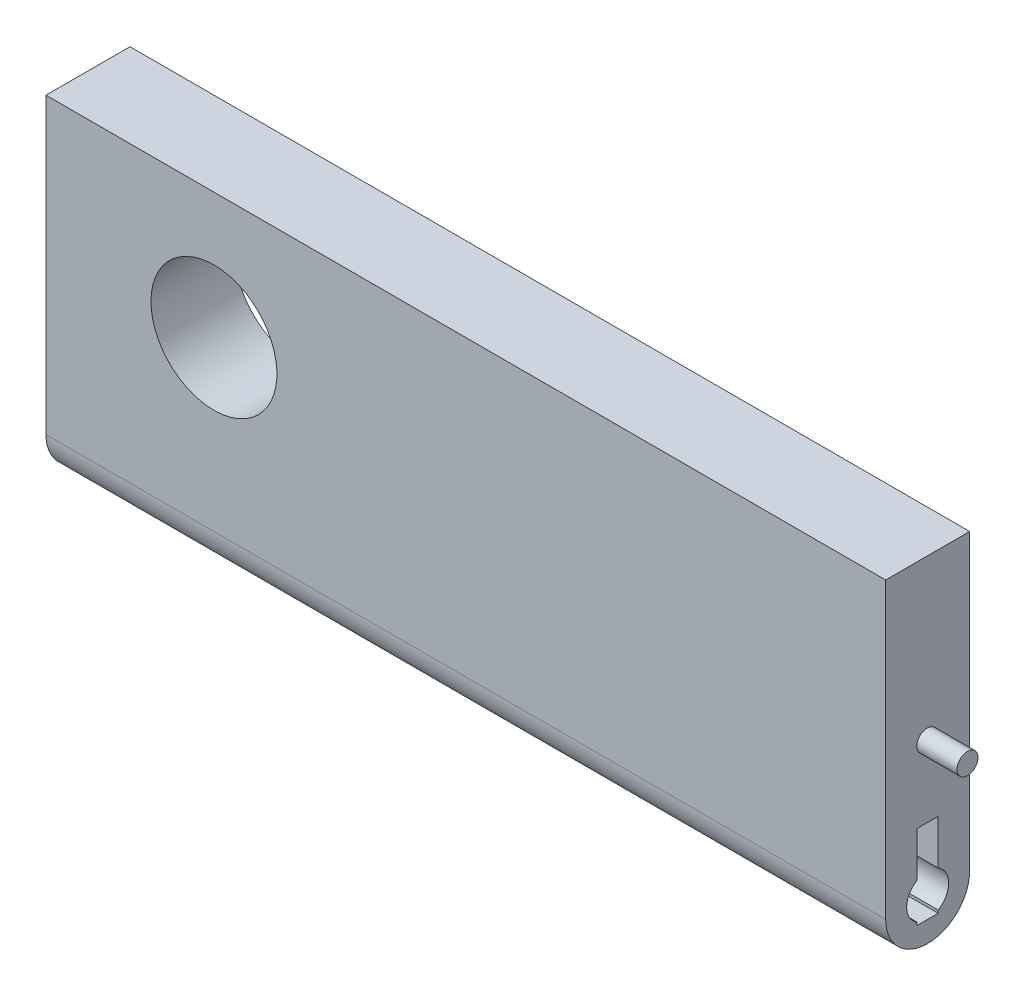
ISO-10303-21;
HEADER;
FILE_DESCRIPTION(('STEP AP214'),'2;1');
FILE_NAME('part.step','',(''),(''),'','','');
FILE_SCHEMA(('AUTOMOTIVE_DESIGN { 1 0 10303 214 1 1 1 1 }'));
ENDSEC;
DATA;
#1=APPLICATION_CONTEXT('core data for automotive mechanical design processes');
#2=APPLICATION_PROTOCOL_DEFINITION('international standard','automotive_design',2000,#1);
#3=PRODUCT_CONTEXT('',#1,'mechanical');
#4=PRODUCT('Part','Part','',(#3));
#5=PRODUCT_RELATED_PRODUCT_CATEGORY('part','',(#4));
#6=PRODUCT_DEFINITION_FORMATION('','',#4);
#7=PRODUCT_DEFINITION_CONTEXT('part definition',#1,'design');
#8=PRODUCT_DEFINITION('design','',#6,#7);
#9=PRODUCT_DEFINITION_SHAPE('','',#8);
#10=(LENGTH_UNIT() NAMED_UNIT(*) SI_UNIT(.MILLI.,.METRE.));
#11=(NAMED_UNIT(*) PLANE_ANGLE_UNIT() SI_UNIT($,.RADIAN.));
#12=(NAMED_UNIT(*) SI_UNIT($,.STERADIAN.) SOLID_ANGLE_UNIT());
#13=UNCERTAINTY_MEASURE_WITH_UNIT(LENGTH_MEASURE(1.E-05),#10,'distance_accuracy_value','');
#14=(GEOMETRIC_REPRESENTATION_CONTEXT(3) GLOBAL_UNCERTAINTY_ASSIGNED_CONTEXT((#13)) GLOBAL_UNIT_ASSIGNED_CONTEXT((#10,
#11,#12)) REPRESENTATION_CONTEXT('',''));
#15=CARTESIAN_POINT('',(0.,0.,0.));
#16=DIRECTION('',(0.,0.,1.));
#17=DIRECTION('',(1.,0.,0.));
#18=AXIS2_PLACEMENT_3D('',#15,#16,#17);
#19=CARTESIAN_POINT('',(28.575,0.,6.35));
#20=DIRECTION('',(-1.,0.,0.));
#21=DIRECTION('',(0.,0.,1.));
#22=AXIS2_PLACEMENT_3D('',#19,#20,#21);
#23=PLANE('',#22);
#24=CARTESIAN_POINT('',(28.575,0.635000000000002,3.20954009812846));
#25=DIRECTION('',(-1.,0.,0.));
#26=DIRECTION('',(0.,0.,1.));
#27=AXIS2_PLACEMENT_3D('',#24,#25,#26);
#28=CIRCLE('',#27,0.79375);
#29=CARTESIAN_POINT('',(28.575,0.635000000000002,4.00329009812846));
#30=VERTEX_POINT('',#29);
#31=EDGE_CURVE('E11',#30,#30,#28,.F.);
#32=ORIENTED_EDGE('',*,*,#31,.F.);
#33=EDGE_LOOP('',(#32));
#34=FACE_BOUND('',#33,.T.);
#35=CARTESIAN_POINT('',(28.575,-9.525,3.175));
#36=DIRECTION('',(1.,0.,0.));
#37=DIRECTION('',(0.,0.,-1.));
#38=AXIS2_PLACEMENT_3D('',#35,#36,#37);
#39=CIRCLE('',#38,1.5875);
#40=CARTESIAN_POINT('',(28.575,-10.8998153285078,2.38125));
#41=VERTEX_POINT('',#40);
#42=CARTESIAN_POINT('',(28.575,-8.1501846714922,2.38125));
#43=VERTEX_POINT('',#42);
#44=EDGE_CURVE('E242',#41,#43,#39,.T.);
#45=ORIENTED_EDGE('',*,*,#44,.F.);
#46=DIRECTION('',(0.,1.,0.));
#47=VECTOR('',#46,1.);
#48=CARTESIAN_POINT('',(28.575,-11.1125,2.38125));
#49=LINE('',#48,#47);
#50=CARTESIAN_POINT('',(28.575,-11.1125,2.38125));
#51=VERTEX_POINT('',#50);
#52=EDGE_CURVE('E205',#51,#41,#49,.T.);
#53=ORIENTED_EDGE('',*,*,#52,.F.);
#54=DIRECTION('',(0.,0.,-1.));
#55=VECTOR('',#54,1.);
#56=CARTESIAN_POINT('',(28.575,-11.1125,3.96875));
#57=LINE('',#56,#55);
#58=CARTESIAN_POINT('',(28.575,-11.1125,3.96875));
#59=VERTEX_POINT('',#58);
#60=EDGE_CURVE('E177',#59,#51,#57,.T.);
#61=ORIENTED_EDGE('',*,*,#60,.F.);
#62=DIRECTION('',(0.,-1.,0.));
#63=VECTOR('',#62,1.);
#64=CARTESIAN_POINT('',(28.575,-11.1125,3.96875));
#65=LINE('',#64,#63);
#66=CARTESIAN_POINT('',(28.575,-10.8998153285078,3.96875));
#67=VERTEX_POINT('',#66);
#68=EDGE_CURVE('E211',#67,#59,#65,.T.);
#69=ORIENTED_EDGE('',*,*,#68,.F.);
#70=CARTESIAN_POINT('',(28.575,-8.1501846714922,3.96875));
#71=VERTEX_POINT('',#70);
#72=EDGE_CURVE('E241',#71,#67,#39,.T.);
#73=ORIENTED_EDGE('',*,*,#72,.F.);
#74=CARTESIAN_POINT('',(28.575,-4.7625,3.96875));
#75=VERTEX_POINT('',#74);
#76=EDGE_CURVE('E212',#75,#71,#65,.T.);
#77=ORIENTED_EDGE('',*,*,#76,.F.);
#78=DIRECTION('',(0.,0.,1.));
#79=VECTOR('',#78,1.);
#80=CARTESIAN_POINT('',(28.575,-4.7625,3.96875));
#81=LINE('',#80,#79);
#82=CARTESIAN_POINT('',(28.575,-4.7625,2.38125));
#83=VERTEX_POINT('',#82);
#84=EDGE_CURVE('E208',#83,#75,#81,.T.);
#85=ORIENTED_EDGE('',*,*,#84,.F.);
#86=EDGE_CURVE('E183',#43,#83,#49,.T.);
#87=ORIENTED_EDGE('',*,*,#86,.F.);
#88=EDGE_LOOP('',(#45,#53,#61,#69,#73,#77,#85,#87));
#89=FACE_BOUND('',#88,.T.);
#90=CARTESIAN_POINT('',(28.575,-9.525,3.175));
#91=DIRECTION('',(-1.,0.,0.));
#92=DIRECTION('',(0.,0.,1.));
#93=AXIS2_PLACEMENT_3D('',#90,#91,#92);
#94=CIRCLE('',#93,3.175);
#95=CARTESIAN_POINT('',(28.575,-9.525,6.35));
#96=VERTEX_POINT('',#95);
#97=CARTESIAN_POINT('',(28.575,-12.7,3.175));
#98=VERTEX_POINT('',#97);
#99=EDGE_CURVE('E283',#96,#98,#94,.F.);
#100=ORIENTED_EDGE('',*,*,#99,.T.);
#101=CARTESIAN_POINT('',(28.575,-9.525,3.175));
#102=DIRECTION('',(-1.,0.,0.));
#103=DIRECTION('',(0.,0.,1.));
#104=AXIS2_PLACEMENT_3D('',#101,#102,#103);
#105=CIRCLE('',#104,3.175);
#106=CARTESIAN_POINT('',(28.575,-9.525,0.));
#107=VERTEX_POINT('',#106);
#108=EDGE_CURVE('E286',#98,#107,#105,.F.);
#109=ORIENTED_EDGE('',*,*,#108,.T.);
#110=DIRECTION('',(0.,1.,0.));
#111=VECTOR('',#110,1.);
#112=CARTESIAN_POINT('',(28.575,0.,0.));
#113=LINE('',#112,#111);
#114=CARTESIAN_POINT('',(28.575,12.7,0.));
#115=VERTEX_POINT('',#114);
#116=EDGE_CURVE('E240',#107,#115,#113,.T.);
#117=ORIENTED_EDGE('',*,*,#116,.T.);
#118=DIRECTION('',(0.,0.,-1.));
#119=VECTOR('',#118,1.);
#120=CARTESIAN_POINT('',(28.575,12.7,6.35));
#121=LINE('',#120,#119);
#122=CARTESIAN_POINT('',(28.575,12.7,6.35));
#123=VERTEX_POINT('',#122);
#124=EDGE_CURVE('E269',#123,#115,#121,.T.);
#125=ORIENTED_EDGE('',*,*,#124,.F.);
#126=DIRECTION('',(0.,1.,0.));
#127=VECTOR('',#126,1.);
#128=CARTESIAN_POINT('',(28.575,0.,6.35));
#129=LINE('',#128,#127);
#130=EDGE_CURVE('E246',#96,#123,#129,.T.);
#131=ORIENTED_EDGE('',*,*,#130,.F.);
#132=EDGE_LOOP('',(#100,#109,#117,#125,#131));
#133=FACE_BOUND('',#132,.T.);
#134=ADVANCED_FACE('F43',(#34,#89,#133),#23,.F.);
#135=CARTESIAN_POINT('',(0.,12.7,6.35));
#136=DIRECTION('',(0.,-1.,0.));
#137=DIRECTION('',(1.,0.,0.));
#138=AXIS2_PLACEMENT_3D('',#135,#136,#137);
#139=PLANE('',#138);
#140=DIRECTION('',(-1.,0.,0.));
#141=VECTOR('',#140,1.);
#142=CARTESIAN_POINT('',(0.,12.7,0.));
#143=LINE('',#142,#141);
#144=CARTESIAN_POINT('',(-34.925,12.7,0.));
#145=VERTEX_POINT('',#144);
#146=EDGE_CURVE('E260',#115,#145,#143,.T.);
#147=ORIENTED_EDGE('',*,*,#146,.T.);
#148=DIRECTION('',(0.,0.,-1.));
#149=VECTOR('',#148,1.);
#150=CARTESIAN_POINT('',(-34.925,12.7,6.35));
#151=LINE('',#150,#149);
#152=CARTESIAN_POINT('',(-34.925,12.7,6.35));
#153=VERTEX_POINT('',#152);
#154=EDGE_CURVE('E257',#153,#145,#151,.T.);
#155=ORIENTED_EDGE('',*,*,#154,.F.);
#156=DIRECTION('',(-1.,0.,0.));
#157=VECTOR('',#156,1.);
#158=CARTESIAN_POINT('',(0.,12.7,6.35));
#159=LINE('',#158,#157);
#160=EDGE_CURVE('E249',#123,#153,#159,.T.);
#161=ORIENTED_EDGE('',*,*,#160,.F.);
#162=ORIENTED_EDGE('',*,*,#124,.T.);
#163=EDGE_LOOP('',(#147,#155,#161,#162));
#164=FACE_BOUND('',#163,.T.);
#165=ADVANCED_FACE('F339',(#164),#139,.F.);
#166=CARTESIAN_POINT('',(-34.925,0.,6.35));
#167=DIRECTION('',(-1.,0.,0.));
#168=DIRECTION('',(0.,0.,1.));
#169=AXIS2_PLACEMENT_3D('',#166,#167,#168);
#170=PLANE('',#169);
#171=CARTESIAN_POINT('',(-34.925,-9.525,3.175));
#172=DIRECTION('',(1.,0.,0.));
#173=DIRECTION('',(0.,0.,-1.));
#174=AXIS2_PLACEMENT_3D('',#171,#172,#173);
#175=CIRCLE('',#174,1.5875);
#176=CARTESIAN_POINT('',(-34.925,-9.525,1.5875));
#177=VERTEX_POINT('',#176);
#178=EDGE_CURVE('E236',#177,#177,#175,.T.);
#179=ORIENTED_EDGE('',*,*,#178,.T.);
#180=EDGE_LOOP('',(#179));
#181=FACE_BOUND('',#180,.T.);
#182=DIRECTION('',(0.,1.,0.));
#183=VECTOR('',#182,1.);
#184=CARTESIAN_POINT('',(-34.925,0.,0.));
#185=LINE('',#184,#183);
#186=CARTESIAN_POINT('',(-34.925,-9.52500000000001,0.));
#187=VERTEX_POINT('',#186);
#188=EDGE_CURVE('E250',#187,#145,#185,.T.);
#189=ORIENTED_EDGE('',*,*,#188,.F.);
#190=CARTESIAN_POINT('',(-34.925,-9.52500000000001,3.175));
#191=DIRECTION('',(-1.,0.,0.));
#192=DIRECTION('',(0.,0.,1.));
#193=AXIS2_PLACEMENT_3D('',#190,#191,#192);
#194=CIRCLE('',#193,3.175);
#195=CARTESIAN_POINT('',(-34.925,-12.7,3.175));
#196=VERTEX_POINT('',#195);
#197=EDGE_CURVE('E280',#187,#196,#194,.T.);
#198=ORIENTED_EDGE('',*,*,#197,.T.);
#199=CARTESIAN_POINT('',(-34.925,-9.52500000000001,3.175));
#200=DIRECTION('',(-1.,0.,0.));
#201=DIRECTION('',(0.,0.,1.));
#202=AXIS2_PLACEMENT_3D('',#199,#200,#201);
#203=CIRCLE('',#202,3.175);
#204=CARTESIAN_POINT('',(-34.925,-9.52500000000001,6.35));
#205=VERTEX_POINT('',#204);
#206=EDGE_CURVE('E277',#196,#205,#203,.T.);
#207=ORIENTED_EDGE('',*,*,#206,.T.);
#208=DIRECTION('',(0.,1.,0.));
#209=VECTOR('',#208,1.);
#210=CARTESIAN_POINT('',(-34.925,0.,6.35));
#211=LINE('',#210,#209);
#212=EDGE_CURVE('E254',#205,#153,#211,.T.);
#213=ORIENTED_EDGE('',*,*,#212,.T.);
#214=ORIENTED_EDGE('',*,*,#154,.T.);
#215=EDGE_LOOP('',(#189,#198,#207,#213,#214));
#216=FACE_BOUND('',#215,.T.);
#217=ADVANCED_FACE('F344',(#181,#216),#170,.T.);
#218=CARTESIAN_POINT('',(0.,0.,6.35));
#219=DIRECTION('',(0.,0.,1.));
#220=DIRECTION('',(1.,0.,0.));
#221=AXIS2_PLACEMENT_3D('',#218,#219,#220);
#222=PLANE('',#221);
#223=CARTESIAN_POINT('',(-22.225,3.175,6.35));
#224=DIRECTION('',(0.,0.,-1.));
#225=DIRECTION('',(-1.,0.,0.));
#226=AXIS2_PLACEMENT_3D('',#223,#224,#225);
#227=CIRCLE('',#226,4.7625);
#228=CARTESIAN_POINT('',(-26.9875,3.175,6.35));
#229=VERTEX_POINT('',#228);
#230=EDGE_CURVE('E228',#229,#229,#227,.T.);
#231=ORIENTED_EDGE('',*,*,#230,.T.);
#232=EDGE_LOOP('',(#231));
#233=FACE_BOUND('',#232,.T.);
#234=ORIENTED_EDGE('',*,*,#212,.F.);
#235=DIRECTION('',(-1.,0.,0.));
#236=VECTOR('',#235,1.);
#237=CARTESIAN_POINT('',(0.,-9.52500000000001,6.35));
#238=LINE('',#237,#236);
#239=EDGE_CURVE('E289',#205,#96,#238,.F.);
#240=ORIENTED_EDGE('',*,*,#239,.T.);
#241=ORIENTED_EDGE('',*,*,#130,.T.);
#242=ORIENTED_EDGE('',*,*,#160,.T.);
#243=EDGE_LOOP('',(#234,#240,#241,#242));
#244=FACE_BOUND('',#243,.T.);
#245=ADVANCED_FACE('F377',(#233,#244),#222,.T.);
#246=CARTESIAN_POINT('',(0.,0.,0.));
#247=DIRECTION('',(0.,0.,1.));
#248=DIRECTION('',(1.,0.,0.));
#249=AXIS2_PLACEMENT_3D('',#246,#247,#248);
#250=PLANE('',#249);
#251=CARTESIAN_POINT('',(-22.225,3.175,0.));
#252=DIRECTION('',(0.,0.,-1.));
#253=DIRECTION('',(-1.,0.,0.));
#254=AXIS2_PLACEMENT_3D('',#251,#252,#253);
#255=CIRCLE('',#254,4.7625);
#256=CARTESIAN_POINT('',(-26.9875,3.175,0.));
#257=VERTEX_POINT('',#256);
#258=EDGE_CURVE('E221',#257,#257,#255,.T.);
#259=ORIENTED_EDGE('',*,*,#258,.F.);
#260=EDGE_LOOP('',(#259));
#261=FACE_BOUND('',#260,.T.);
#262=ORIENTED_EDGE('',*,*,#116,.F.);
#263=DIRECTION('',(-1.,0.,0.));
#264=VECTOR('',#263,1.);
#265=CARTESIAN_POINT('',(-34.925,-9.52500000000001,0.));
#266=LINE('',#265,#264);
#267=EDGE_CURVE('E273',#107,#187,#266,.T.);
#268=ORIENTED_EDGE('',*,*,#267,.T.);
#269=ORIENTED_EDGE('',*,*,#188,.T.);
#270=ORIENTED_EDGE('',*,*,#146,.F.);
#271=EDGE_LOOP('',(#262,#268,#269,#270));
#272=FACE_BOUND('',#271,.T.);
#273=ADVANCED_FACE('F368',(#261,#272),#250,.F.);
#274=CARTESIAN_POINT('',(-34.925,-9.525,3.175));
#275=DIRECTION('',(1.,0.,0.));
#276=DIRECTION('',(0.,0.,-1.));
#277=AXIS2_PLACEMENT_3D('',#274,#275,#276);
#278=CYLINDRICAL_SURFACE('',#277,1.5875);
#279=CARTESIAN_POINT('',(25.4,-9.525,3.175));
#280=DIRECTION('',(-1.,0.,0.));
#281=DIRECTION('',(0.,0.,1.));
#282=AXIS2_PLACEMENT_3D('',#279,#280,#281);
#283=CIRCLE('',#282,1.5875);
#284=CARTESIAN_POINT('',(25.4,-11.1125,3.175));
#285=VERTEX_POINT('',#284);
#286=CARTESIAN_POINT('',(25.4,-10.8998153285078,2.38125));
#287=VERTEX_POINT('',#286);
#288=EDGE_CURVE('E299',#285,#287,#283,.F.);
#289=ORIENTED_EDGE('',*,*,#288,.T.);
#290=DIRECTION('',(1.,0.,0.));
#291=VECTOR('',#290,1.);
#292=CARTESIAN_POINT('',(-34.925,-10.8998153285078,2.38125));
#293=LINE('',#292,#291);
#294=EDGE_CURVE('E52',#287,#41,#293,.T.);
#295=ORIENTED_EDGE('',*,*,#294,.T.);
#296=ORIENTED_EDGE('',*,*,#44,.T.);
#297=DIRECTION('',(1.,0.,0.));
#298=VECTOR('',#297,1.);
#299=CARTESIAN_POINT('',(-34.925,-8.1501846714922,2.38125));
#300=LINE('',#299,#298);
#301=CARTESIAN_POINT('',(25.4,-8.1501846714922,2.38125));
#302=VERTEX_POINT('',#301);
#303=EDGE_CURVE('E303',#43,#302,#300,.F.);
#304=ORIENTED_EDGE('',*,*,#303,.T.);
#305=CARTESIAN_POINT('',(25.4,-8.1501846714922,3.96875));
#306=VERTEX_POINT('',#305);
#307=EDGE_CURVE('E173',#302,#306,#283,.F.);
#308=ORIENTED_EDGE('',*,*,#307,.T.);
#309=DIRECTION('',(1.,0.,0.));
#310=VECTOR('',#309,1.);
#311=CARTESIAN_POINT('',(-34.925,-8.1501846714922,3.96875));
#312=LINE('',#311,#310);
#313=EDGE_CURVE('E297',#306,#71,#312,.T.);
#314=ORIENTED_EDGE('',*,*,#313,.T.);
#315=ORIENTED_EDGE('',*,*,#72,.T.);
#316=DIRECTION('',(1.,0.,0.));
#317=VECTOR('',#316,1.);
#318=CARTESIAN_POINT('',(-34.925,-10.8998153285078,3.96875));
#319=LINE('',#318,#317);
#320=CARTESIAN_POINT('',(25.4,-10.8998153285078,3.96875));
#321=VERTEX_POINT('',#320);
#322=EDGE_CURVE('E306',#67,#321,#319,.F.);
#323=ORIENTED_EDGE('',*,*,#322,.T.);
#324=EDGE_CURVE('E298',#321,#285,#283,.F.);
#325=ORIENTED_EDGE('',*,*,#324,.T.);
#326=EDGE_LOOP('',(#289,#295,#296,#304,#308,#314,#315,#323,#325));
#327=FACE_BOUND('',#326,.T.);
#328=ORIENTED_EDGE('',*,*,#178,.F.);
#329=EDGE_LOOP('',(#328));
#330=FACE_BOUND('',#329,.T.);
#331=ADVANCED_FACE('F314',(#327,#330),#278,.F.);
#332=CARTESIAN_POINT('',(0.,-9.52500000000001,3.175));
#333=DIRECTION('',(-1.,0.,0.));
#334=DIRECTION('',(0.,-1.,0.));
#335=AXIS2_PLACEMENT_3D('',#332,#333,#334);
#336=CYLINDRICAL_SURFACE('',#335,3.175);
#337=DIRECTION('',(-1.,0.,0.));
#338=VECTOR('',#337,1.);
#339=CARTESIAN_POINT('',(0.,-12.7,3.175));
#340=LINE('',#339,#338);
#341=EDGE_CURVE('E232',#98,#196,#340,.T.);
#342=ORIENTED_EDGE('',*,*,#341,.F.);
#343=ORIENTED_EDGE('',*,*,#99,.F.);
#344=ORIENTED_EDGE('',*,*,#239,.F.);
#345=ORIENTED_EDGE('',*,*,#206,.F.);
#346=EDGE_LOOP('',(#342,#343,#344,#345));
#347=FACE_BOUND('',#346,.T.);
#348=ADVANCED_FACE('F45',(#347),#336,.T.);
#349=CARTESIAN_POINT('',(0.,-9.52500000000001,3.175));
#350=DIRECTION('',(1.,0.,0.));
#351=DIRECTION('',(0.,1.,0.));
#352=AXIS2_PLACEMENT_3D('',#349,#350,#351);
#353=CYLINDRICAL_SURFACE('',#352,3.175);
#354=ORIENTED_EDGE('',*,*,#108,.F.);
#355=ORIENTED_EDGE('',*,*,#341,.T.);
#356=ORIENTED_EDGE('',*,*,#197,.F.);
#357=ORIENTED_EDGE('',*,*,#267,.F.);
#358=EDGE_LOOP('',(#354,#355,#356,#357));
#359=FACE_BOUND('',#358,.T.);
#360=ADVANCED_FACE('F348',(#359),#353,.T.);
#361=CARTESIAN_POINT('',(-22.225,3.175,6.35));
#362=DIRECTION('',(0.,0.,-1.));
#363=DIRECTION('',(-1.,0.,0.));
#364=AXIS2_PLACEMENT_3D('',#361,#362,#363);
#365=CYLINDRICAL_SURFACE('',#364,4.7625);
#366=ORIENTED_EDGE('',*,*,#230,.F.);
#367=EDGE_LOOP('',(#366));
#368=FACE_BOUND('',#367,.T.);
#369=ORIENTED_EDGE('',*,*,#258,.T.);
#370=EDGE_LOOP('',(#369));
#371=FACE_BOUND('',#370,.T.);
#372=ADVANCED_FACE('F350',(#368,#371),#365,.F.);
#373=CARTESIAN_POINT('',(25.4,0.,0.));
#374=DIRECTION('',(-1.,0.,0.));
#375=DIRECTION('',(0.,0.,1.));
#376=AXIS2_PLACEMENT_3D('',#373,#374,#375);
#377=PLANE('',#376);
#378=DIRECTION('',(0.,1.,0.));
#379=VECTOR('',#378,1.);
#380=CARTESIAN_POINT('',(25.4,-11.1125,2.38125));
#381=LINE('',#380,#379);
#382=CARTESIAN_POINT('',(25.4,-4.7625,2.38125));
#383=VERTEX_POINT('',#382);
#384=EDGE_CURVE('E167',#302,#383,#381,.T.);
#385=ORIENTED_EDGE('',*,*,#384,.T.);
#386=DIRECTION('',(0.,0.,1.));
#387=VECTOR('',#386,1.);
#388=CARTESIAN_POINT('',(25.4,-4.7625,3.96875));
#389=LINE('',#388,#387);
#390=CARTESIAN_POINT('',(25.4,-4.7625,3.96875));
#391=VERTEX_POINT('',#390);
#392=EDGE_CURVE('E171',#383,#391,#389,.T.);
#393=ORIENTED_EDGE('',*,*,#392,.T.);
#394=DIRECTION('',(0.,-1.,0.));
#395=VECTOR('',#394,1.);
#396=CARTESIAN_POINT('',(25.4,-11.1125,3.96875));
#397=LINE('',#396,#395);
#398=EDGE_CURVE('E73',#391,#306,#397,.T.);
#399=ORIENTED_EDGE('',*,*,#398,.T.);
#400=ORIENTED_EDGE('',*,*,#307,.F.);
#401=EDGE_LOOP('',(#385,#393,#399,#400));
#402=FACE_BOUND('',#401,.T.);
#403=ADVANCED_FACE('F169',(#402),#377,.F.);
#404=CARTESIAN_POINT('',(25.4,-11.1125,3.96875));
#405=DIRECTION('',(0.,0.,1.));
#406=DIRECTION('',(1.,0.,0.));
#407=AXIS2_PLACEMENT_3D('',#404,#405,#406);
#408=PLANE('',#407);
#409=ORIENTED_EDGE('',*,*,#398,.F.);
#410=DIRECTION('',(1.,0.,0.));
#411=VECTOR('',#410,1.);
#412=CARTESIAN_POINT('',(25.4,-4.7625,3.96875));
#413=LINE('',#412,#411);
#414=EDGE_CURVE('E188',#391,#75,#413,.T.);
#415=ORIENTED_EDGE('',*,*,#414,.T.);
#416=ORIENTED_EDGE('',*,*,#76,.T.);
#417=ORIENTED_EDGE('',*,*,#313,.F.);
#418=EDGE_LOOP('',(#409,#415,#416,#417));
#419=FACE_BOUND('',#418,.T.);
#420=ADVANCED_FACE('F393',(#419),#408,.F.);
#421=CARTESIAN_POINT('',(25.4,-11.1125,2.38125));
#422=DIRECTION('',(0.,0.,-1.));
#423=DIRECTION('',(0.,1.,0.));
#424=AXIS2_PLACEMENT_3D('',#421,#422,#423);
#425=PLANE('',#424);
#426=ORIENTED_EDGE('',*,*,#86,.T.);
#427=DIRECTION('',(1.,0.,0.));
#428=VECTOR('',#427,1.);
#429=CARTESIAN_POINT('',(25.4,-4.7625,2.38125));
#430=LINE('',#429,#428);
#431=EDGE_CURVE('E180',#383,#83,#430,.T.);
#432=ORIENTED_EDGE('',*,*,#431,.F.);
#433=ORIENTED_EDGE('',*,*,#384,.F.);
#434=ORIENTED_EDGE('',*,*,#303,.F.);
#435=EDGE_LOOP('',(#426,#432,#433,#434));
#436=FACE_BOUND('',#435,.T.);
#437=ADVANCED_FACE('F181',(#436),#425,.F.);
#438=CARTESIAN_POINT('',(25.4,-4.7625,3.96875));
#439=DIRECTION('',(0.,1.,0.));
#440=DIRECTION('',(0.,0.,1.));
#441=AXIS2_PLACEMENT_3D('',#438,#439,#440);
#442=PLANE('',#441);
#443=ORIENTED_EDGE('',*,*,#84,.T.);
#444=ORIENTED_EDGE('',*,*,#414,.F.);
#445=ORIENTED_EDGE('',*,*,#392,.F.);
#446=ORIENTED_EDGE('',*,*,#431,.T.);
#447=EDGE_LOOP('',(#443,#444,#445,#446));
#448=FACE_BOUND('',#447,.T.);
#449=ADVANCED_FACE('F191',(#448),#442,.F.);
#450=CARTESIAN_POINT('',(25.4,-11.1125,2.38125));
#451=VERTEX_POINT('',#450);
#452=EDGE_CURVE('E62',#451,#287,#381,.T.);
#453=ORIENTED_EDGE('',*,*,#452,.F.);
#454=DIRECTION('',(1.,0.,0.));
#455=VECTOR('',#454,1.);
#456=CARTESIAN_POINT('',(25.4,-11.1125,2.38125));
#457=LINE('',#456,#455);
#458=EDGE_CURVE('E217',#451,#51,#457,.T.);
#459=ORIENTED_EDGE('',*,*,#458,.T.);
#460=ORIENTED_EDGE('',*,*,#52,.T.);
#461=ORIENTED_EDGE('',*,*,#294,.F.);
#462=EDGE_LOOP('',(#453,#459,#460,#461));
#463=FACE_BOUND('',#462,.T.);
#464=ADVANCED_FACE('F394',(#463),#425,.F.);
#465=CARTESIAN_POINT('',(25.4,-11.1125,3.96875));
#466=DIRECTION('',(0.,-1.,0.));
#467=DIRECTION('',(0.,0.,-1.));
#468=AXIS2_PLACEMENT_3D('',#465,#466,#467);
#469=PLANE('',#468);
#470=ORIENTED_EDGE('',*,*,#60,.T.);
#471=ORIENTED_EDGE('',*,*,#458,.F.);
#472=DIRECTION('',(0.,0.,-1.));
#473=VECTOR('',#472,1.);
#474=CARTESIAN_POINT('',(25.4,-11.1125,3.96875));
#475=LINE('',#474,#473);
#476=EDGE_CURVE('E201',#285,#451,#475,.T.);
#477=ORIENTED_EDGE('',*,*,#476,.F.);
#478=CARTESIAN_POINT('',(25.4,-11.1125,3.96875));
#479=VERTEX_POINT('',#478);
#480=EDGE_CURVE('E189',#479,#285,#475,.T.);
#481=ORIENTED_EDGE('',*,*,#480,.F.);
#482=DIRECTION('',(1.,0.,0.));
#483=VECTOR('',#482,1.);
#484=CARTESIAN_POINT('',(25.4,-11.1125,3.96875));
#485=LINE('',#484,#483);
#486=EDGE_CURVE('E222',#479,#59,#485,.T.);
#487=ORIENTED_EDGE('',*,*,#486,.T.);
#488=EDGE_LOOP('',(#470,#471,#477,#481,#487));
#489=FACE_BOUND('',#488,.T.);
#490=ADVANCED_FACE('F401',(#489),#469,.F.);
#491=ORIENTED_EDGE('',*,*,#68,.T.);
#492=ORIENTED_EDGE('',*,*,#486,.F.);
#493=EDGE_CURVE('E193',#321,#479,#397,.T.);
#494=ORIENTED_EDGE('',*,*,#493,.F.);
#495=ORIENTED_EDGE('',*,*,#322,.F.);
#496=EDGE_LOOP('',(#491,#492,#494,#495));
#497=FACE_BOUND('',#496,.T.);
#498=ADVANCED_FACE('F397',(#497),#408,.F.);
#499=ORIENTED_EDGE('',*,*,#493,.T.);
#500=ORIENTED_EDGE('',*,*,#480,.T.);
#501=ORIENTED_EDGE('',*,*,#324,.F.);
#502=EDGE_LOOP('',(#499,#500,#501));
#503=FACE_BOUND('',#502,.T.);
#504=ADVANCED_FACE('F400',(#503),#377,.F.);
#505=ORIENTED_EDGE('',*,*,#476,.T.);
#506=ORIENTED_EDGE('',*,*,#452,.T.);
#507=ORIENTED_EDGE('',*,*,#288,.F.);
#508=EDGE_LOOP('',(#505,#506,#507));
#509=FACE_BOUND('',#508,.T.);
#510=ADVANCED_FACE('F334',(#509),#377,.F.);
#511=CARTESIAN_POINT('',(31.623,0.635000000000002,3.20954009812846));
#512=DIRECTION('',(-1.,0.,0.));
#513=DIRECTION('',(0.,0.,1.));
#514=AXIS2_PLACEMENT_3D('',#511,#512,#513);
#515=CYLINDRICAL_SURFACE('',#514,0.79375);
#516=CARTESIAN_POINT('',(31.623,0.635000000000002,3.20954009812846));
#517=DIRECTION('',(1.,0.,0.));
#518=DIRECTION('',(0.,0.,-1.));
#519=AXIS2_PLACEMENT_3D('',#516,#517,#518);
#520=CIRCLE('',#519,0.79375);
#521=CARTESIAN_POINT('',(31.623,0.635000000000002,4.00329009812846));
#522=VERTEX_POINT('',#521);
#523=EDGE_CURVE('E324',#522,#522,#520,.T.);
#524=CARTESIAN_POINT('',(31.623,0.635000000000002,4.00329009812846));
#525=CARTESIAN_POINT('',(31.59125,0.635000000000002,4.00329009812846));
#526=CARTESIAN_POINT('',(31.5595,0.635000000000002,4.00329009812846));
#527=CARTESIAN_POINT('',(31.496,0.635000000000002,4.00329009812846));
#528=CARTESIAN_POINT('',(31.46425,0.635000000000002,4.00329009812846));
#529=CARTESIAN_POINT('',(31.40075,0.635000000000002,4.00329009812846));
#530=CARTESIAN_POINT('',(31.369,0.635000000000002,4.00329009812846));
#531=CARTESIAN_POINT('',(31.3055,0.635000000000002,4.00329009812846));
#532=CARTESIAN_POINT('',(31.27375,0.635000000000002,4.00329009812846));
#533=CARTESIAN_POINT('',(31.21025,0.635000000000002,4.00329009812846));
#534=CARTESIAN_POINT('',(31.1785,0.635000000000002,4.00329009812846));
#535=CARTESIAN_POINT('',(31.115,0.635000000000002,4.00329009812846));
#536=CARTESIAN_POINT('',(31.08325,0.635000000000002,4.00329009812846));
#537=CARTESIAN_POINT('',(31.01975,0.635000000000002,4.00329009812846));
#538=CARTESIAN_POINT('',(30.988,0.635000000000002,4.00329009812846));
#539=CARTESIAN_POINT('',(30.9245,0.635000000000002,4.00329009812846));
#540=CARTESIAN_POINT('',(30.89275,0.635000000000002,4.00329009812846));
#541=CARTESIAN_POINT('',(30.82925,0.635000000000002,4.00329009812846));
#542=CARTESIAN_POINT('',(30.7975,0.635000000000002,4.00329009812846));
#543=CARTESIAN_POINT('',(30.734,0.635000000000002,4.00329009812846));
#544=CARTESIAN_POINT('',(30.70225,0.635000000000002,4.00329009812846));
#545=CARTESIAN_POINT('',(30.63875,0.635000000000002,4.00329009812846));
#546=CARTESIAN_POINT('',(30.607,0.635000000000002,4.00329009812846));
#547=CARTESIAN_POINT('',(30.5435,0.635000000000002,4.00329009812846));
#548=CARTESIAN_POINT('',(30.51175,0.635000000000002,4.00329009812846));
#549=CARTESIAN_POINT('',(30.44825,0.635000000000002,4.00329009812846));
#550=CARTESIAN_POINT('',(30.4165,0.635000000000002,4.00329009812846));
#551=CARTESIAN_POINT('',(30.353,0.635000000000002,4.00329009812846));
#552=CARTESIAN_POINT('',(30.32125,0.635000000000002,4.00329009812846));
#553=CARTESIAN_POINT('',(30.25775,0.635000000000002,4.00329009812846));
#554=CARTESIAN_POINT('',(30.226,0.635000000000002,4.00329009812846));
#555=CARTESIAN_POINT('',(30.1625,0.635000000000002,4.00329009812846));
#556=CARTESIAN_POINT('',(30.13075,0.635000000000002,4.00329009812846));
#557=CARTESIAN_POINT('',(30.06725,0.635000000000002,4.00329009812846));
#558=CARTESIAN_POINT('',(30.0355,0.635000000000002,4.00329009812846));
#559=CARTESIAN_POINT('',(29.972,0.635000000000002,4.00329009812846));
#560=CARTESIAN_POINT('',(29.94025,0.635000000000002,4.00329009812846));
#561=CARTESIAN_POINT('',(29.87675,0.635000000000002,4.00329009812846));
#562=CARTESIAN_POINT('',(29.845,0.635000000000002,4.00329009812846));
#563=CARTESIAN_POINT('',(29.7815,0.635000000000002,4.00329009812846));
#564=CARTESIAN_POINT('',(29.74975,0.635000000000002,4.00329009812846));
#565=CARTESIAN_POINT('',(29.68625,0.635000000000002,4.00329009812846));
#566=CARTESIAN_POINT('',(29.6545,0.635000000000002,4.00329009812846));
#567=CARTESIAN_POINT('',(29.591,0.635000000000002,4.00329009812846));
#568=CARTESIAN_POINT('',(29.55925,0.635000000000002,4.00329009812846));
#569=CARTESIAN_POINT('',(29.49575,0.635000000000002,4.00329009812846));
#570=CARTESIAN_POINT('',(29.464,0.635000000000002,4.00329009812846));
#571=CARTESIAN_POINT('',(29.4005,0.635000000000002,4.00329009812846));
#572=CARTESIAN_POINT('',(29.36875,0.635000000000002,4.00329009812846));
#573=CARTESIAN_POINT('',(29.30525,0.635000000000002,4.00329009812846));
#574=CARTESIAN_POINT('',(29.2735,0.635000000000002,4.00329009812846));
#575=CARTESIAN_POINT('',(29.21,0.635000000000002,4.00329009812846));
#576=CARTESIAN_POINT('',(29.17825,0.635000000000002,4.00329009812846));
#577=CARTESIAN_POINT('',(29.11475,0.635000000000002,4.00329009812846));
#578=CARTESIAN_POINT('',(29.083,0.635000000000002,4.00329009812846));
#579=CARTESIAN_POINT('',(29.0195,0.635000000000002,4.00329009812846));
#580=CARTESIAN_POINT('',(28.98775,0.635000000000002,4.00329009812846));
#581=CARTESIAN_POINT('',(28.92425,0.635000000000002,4.00329009812846));
#582=CARTESIAN_POINT('',(28.8925,0.635000000000002,4.00329009812846));
#583=CARTESIAN_POINT('',(28.829,0.635000000000002,4.00329009812846));
#584=CARTESIAN_POINT('',(28.79725,0.635000000000002,4.00329009812846));
#585=CARTESIAN_POINT('',(28.73375,0.635000000000002,4.00329009812846));
#586=CARTESIAN_POINT('',(28.702,0.635000000000002,4.00329009812846));
#587=CARTESIAN_POINT('',(28.6385,0.635000000000002,4.00329009812846));
#588=CARTESIAN_POINT('',(28.60675,0.635000000000002,4.00329009812846));
#589=CARTESIAN_POINT('',(28.575,0.635000000000002,4.00329009812846));
#590=B_SPLINE_CURVE_WITH_KNOTS('',3,(#524,#525,#526,#527,#528,#529,#530,#531,#532,#533,#534,
#535,#536,#537,#538,#539,#540,#541,#542,#543,#544,#545,#546,#547,#548,#549,#550,#551,#552,#553,
#554,#555,#556,#557,#558,#559,#560,#561,#562,#563,#564,#565,#566,#567,#568,#569,#570,#571,#572,
#573,#574,#575,#576,#577,#578,#579,#580,#581,#582,#583,#584,#585,#586,#587,#588,#589),
.UNSPECIFIED.,.F.,.F.,(4,2,2,2,2,2,2,2,2,2,2,2,2,2,2,2,2,2,2,2,2,2,2,2,2,2,2,2,2,2,2,2,4),(0.,
0.0952500000000051,0.190500000000003,0.285750000000001,0.381000000000003,0.476250000000004,
0.571500000000003,0.666750000000004,0.762000000000002,0.857250000000004,0.952500000000002,
1.04775,1.143,1.23825,1.3335,1.42875,1.524,1.61925,1.7145,1.80975,1.905,2.00025,2.0955,2.19075,
2.286,2.38125,2.4765,2.57175,2.667,2.76225,2.8575,2.95275,3.048),.UNSPECIFIED.);
#591=EDGE_CURVE('BSEAM331',#522,#30,#590,.T.);
#592=ORIENTED_EDGE('',*,*,#523,.F.);
#593=ORIENTED_EDGE('',*,*,#31,.T.);
#594=ORIENTED_EDGE('',*,*,#591,.T.);
#595=ORIENTED_EDGE('',*,*,#591,.F.);
#596=EDGE_LOOP('',(#592,#594,#593,#595));
#597=FACE_BOUND('',#596,.T.);
#598=ADVANCED_FACE('F331',(#597),#515,.T.);
#599=CARTESIAN_POINT('',(31.623,0.635000000000002,3.20954009812846));
#600=DIRECTION('',(1.,0.,0.));
#601=DIRECTION('',(0.,0.,-1.));
#602=AXIS2_PLACEMENT_3D('',#599,#600,#601);
#603=PLANE('',#602);
#604=ORIENTED_EDGE('',*,*,#523,.T.);
#605=EDGE_LOOP('',(#604));
#606=FACE_BOUND('',#605,.T.);
#607=ADVANCED_FACE('F329',(#606),#603,.T.);
#608=CLOSED_SHELL('',(#134,#165,#217,#245,#273,#331,#348,#360,#372,#403,#420,#437,#449,#464,
#490,#498,#504,#510,#598,#607));
#609=MANIFOLD_SOLID_BREP('B2',#608);
#610=ADVANCED_BREP_SHAPE_REPRESENTATION('',(#18,#609),#14);
#611=SHAPE_DEFINITION_REPRESENTATION(#9,#610);
ENDSEC;
END-ISO-10303-21;
